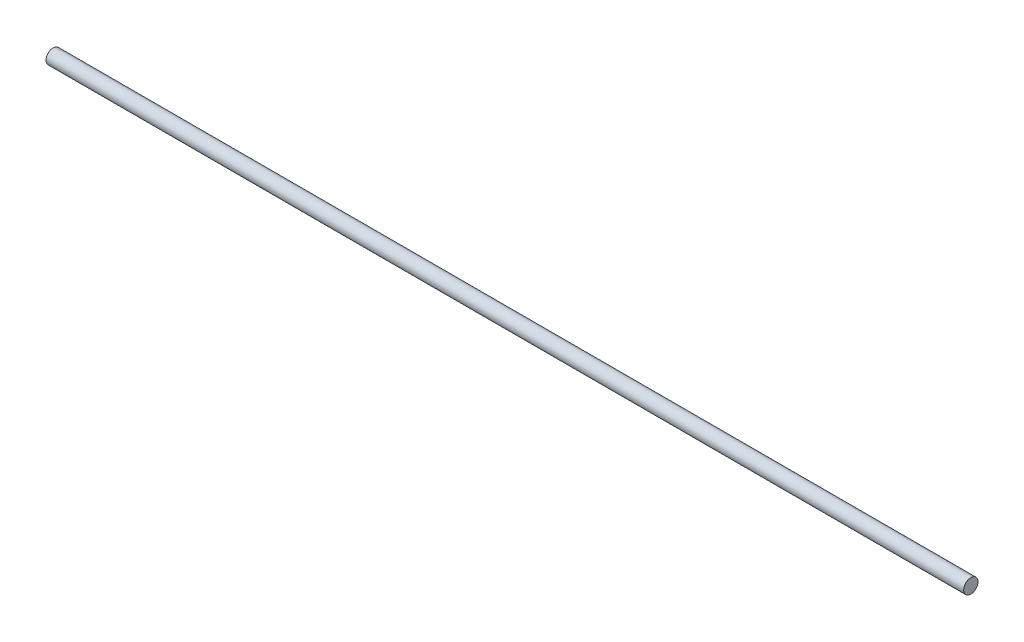
ISO-10303-21;
HEADER;
FILE_DESCRIPTION(('STEP AP214'),'2;1');
FILE_NAME('part.step','',(''),(''),'','','');
FILE_SCHEMA(('AUTOMOTIVE_DESIGN { 1 0 10303 214 1 1 1 1 }'));
ENDSEC;
DATA;
#1=APPLICATION_CONTEXT('core data for automotive mechanical design processes');
#2=APPLICATION_PROTOCOL_DEFINITION('international standard','automotive_design',2000,#1);
#3=PRODUCT_CONTEXT('',#1,'mechanical');
#4=PRODUCT('Part','Part','',(#3));
#5=PRODUCT_RELATED_PRODUCT_CATEGORY('part','',(#4));
#6=PRODUCT_DEFINITION_FORMATION('','',#4);
#7=PRODUCT_DEFINITION_CONTEXT('part definition',#1,'design');
#8=PRODUCT_DEFINITION('design','',#6,#7);
#9=PRODUCT_DEFINITION_SHAPE('','',#8);
#10=(LENGTH_UNIT() NAMED_UNIT(*) SI_UNIT(.MILLI.,.METRE.));
#11=(NAMED_UNIT(*) PLANE_ANGLE_UNIT() SI_UNIT($,.RADIAN.));
#12=(NAMED_UNIT(*) SI_UNIT($,.STERADIAN.) SOLID_ANGLE_UNIT());
#13=UNCERTAINTY_MEASURE_WITH_UNIT(LENGTH_MEASURE(1.E-05),#10,'distance_accuracy_value','');
#14=(GEOMETRIC_REPRESENTATION_CONTEXT(3) GLOBAL_UNCERTAINTY_ASSIGNED_CONTEXT((#13)) GLOBAL_UNIT_ASSIGNED_CONTEXT((#10,
#11,#12)) REPRESENTATION_CONTEXT('',''));
#15=CARTESIAN_POINT('',(0.,0.,0.));
#16=DIRECTION('',(0.,0.,1.));
#17=DIRECTION('',(1.,0.,0.));
#18=AXIS2_PLACEMENT_3D('',#15,#16,#17);
#19=CARTESIAN_POINT('',(0.,0.,0.));
#20=DIRECTION('',(-1.,0.,0.));
#21=DIRECTION('',(0.,0.,1.));
#22=AXIS2_PLACEMENT_3D('',#19,#20,#21);
#23=PLANE('',#22);
#24=CARTESIAN_POINT('',(0.,0.,0.));
#25=DIRECTION('',(-1.,0.,0.));
#26=DIRECTION('',(0.,0.,1.));
#27=AXIS2_PLACEMENT_3D('',#24,#25,#26);
#28=CIRCLE('',#27,9.525);
#29=CARTESIAN_POINT('',(0.,0.,9.525));
#30=VERTEX_POINT('',#29);
#31=EDGE_CURVE('E47',#30,#30,#28,.T.);
#32=ORIENTED_EDGE('',*,*,#31,.F.);
#33=EDGE_LOOP('',(#32));
#34=FACE_BOUND('',#33,.T.);
#35=ADVANCED_FACE('F40',(#34),#23,.F.);
#36=CARTESIAN_POINT('',(-1219.2,0.,1.49308937752045E-13));
#37=DIRECTION('',(-1.,0.,0.));
#38=DIRECTION('',(0.,0.,1.));
#39=AXIS2_PLACEMENT_3D('',#36,#37,#38);
#40=PLANE('',#39);
#41=CARTESIAN_POINT('',(-1219.2,0.,1.49308937752045E-13));
#42=DIRECTION('',(-1.,0.,0.));
#43=DIRECTION('',(0.,0.,1.));
#44=AXIS2_PLACEMENT_3D('',#41,#42,#43);
#45=CIRCLE('',#44,9.525);
#46=CARTESIAN_POINT('',(-1219.2,0.,9.52500000000015));
#47=VERTEX_POINT('',#46);
#48=EDGE_CURVE('E12',#47,#47,#45,.T.);
#49=ORIENTED_EDGE('',*,*,#48,.T.);
#50=EDGE_LOOP('',(#49));
#51=FACE_BOUND('',#50,.T.);
#52=ADVANCED_FACE('F54',(#51),#40,.T.);
#53=CARTESIAN_POINT('',(0.,0.,0.));
#54=DIRECTION('',(-1.,0.,0.));
#55=DIRECTION('',(0.,0.,1.));
#56=AXIS2_PLACEMENT_3D('',#53,#54,#55);
#57=CYLINDRICAL_SURFACE('',#56,9.525);
#58=ORIENTED_EDGE('',*,*,#48,.F.);
#59=EDGE_LOOP('',(#58));
#60=FACE_BOUND('',#59,.T.);
#61=ORIENTED_EDGE('',*,*,#31,.T.);
#62=EDGE_LOOP('',(#61));
#63=FACE_BOUND('',#62,.T.);
#64=ADVANCED_FACE('F56',(#60,#63),#57,.T.);
#65=CLOSED_SHELL('',(#35,#52,#64));
#66=MANIFOLD_SOLID_BREP('B2',#65);
#67=ADVANCED_BREP_SHAPE_REPRESENTATION('',(#18,#66),#14);
#68=SHAPE_DEFINITION_REPRESENTATION(#9,#67);
ENDSEC;
END-ISO-10303-21;
